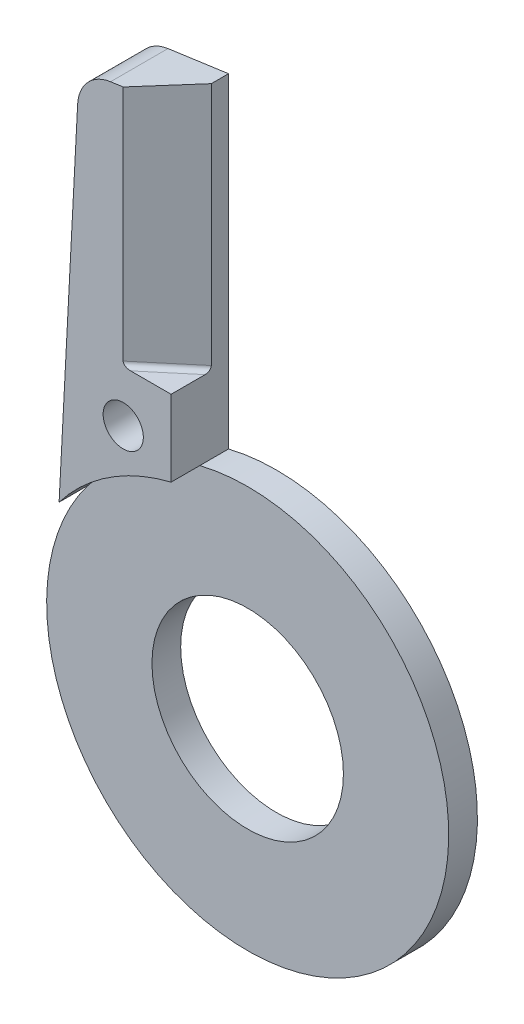
ISO-10303-21;
HEADER;
FILE_DESCRIPTION(('STEP AP214'),'2;1');
FILE_NAME('part.step','',(''),(''),'','','');
FILE_SCHEMA(('AUTOMOTIVE_DESIGN { 1 0 10303 214 1 1 1 1 }'));
ENDSEC;
DATA;
#1=APPLICATION_CONTEXT('core data for automotive mechanical design processes');
#2=APPLICATION_PROTOCOL_DEFINITION('international standard','automotive_design',2000,#1);
#3=PRODUCT_CONTEXT('',#1,'mechanical');
#4=PRODUCT('Part','Part','',(#3));
#5=PRODUCT_RELATED_PRODUCT_CATEGORY('part','',(#4));
#6=PRODUCT_DEFINITION_FORMATION('','',#4);
#7=PRODUCT_DEFINITION_CONTEXT('part definition',#1,'design');
#8=PRODUCT_DEFINITION('design','',#6,#7);
#9=PRODUCT_DEFINITION_SHAPE('','',#8);
#10=(LENGTH_UNIT() NAMED_UNIT(*) SI_UNIT(.MILLI.,.METRE.));
#11=(NAMED_UNIT(*) PLANE_ANGLE_UNIT() SI_UNIT($,.RADIAN.));
#12=(NAMED_UNIT(*) SI_UNIT($,.STERADIAN.) SOLID_ANGLE_UNIT());
#13=UNCERTAINTY_MEASURE_WITH_UNIT(LENGTH_MEASURE(1.E-05),#10,'distance_accuracy_value','');
#14=(GEOMETRIC_REPRESENTATION_CONTEXT(3) GLOBAL_UNCERTAINTY_ASSIGNED_CONTEXT((#13)) GLOBAL_UNIT_ASSIGNED_CONTEXT((#10,
#11,#12)) REPRESENTATION_CONTEXT('',''));
#15=CARTESIAN_POINT('',(0.,0.,0.));
#16=DIRECTION('',(0.,0.,1.));
#17=DIRECTION('',(1.,0.,0.));
#18=AXIS2_PLACEMENT_3D('',#15,#16,#17);
#19=CARTESIAN_POINT('',(0.,0.,6.));
#20=DIRECTION('',(0.,0.,-1.));
#21=DIRECTION('',(-1.,0.,0.));
#22=AXIS2_PLACEMENT_3D('',#19,#20,#21);
#23=CYLINDRICAL_SURFACE('',#22,21.);
#24=CARTESIAN_POINT('',(0.,0.,3.));
#25=DIRECTION('',(0.,0.,1.));
#26=DIRECTION('',(1.,0.,0.));
#27=AXIS2_PLACEMENT_3D('',#24,#25,#26);
#28=CIRCLE('',#27,21.);
#29=CARTESIAN_POINT('',(-16.7,12.7322425361756,3.));
#30=VERTEX_POINT('',#29);
#31=CARTESIAN_POINT('',(-4.99999999999998,20.3960780543711,3.));
#32=VERTEX_POINT('',#31);
#33=EDGE_CURVE('E190',#30,#32,#28,.T.);
#34=ORIENTED_EDGE('',*,*,#33,.F.);
#35=DIRECTION('',(0.,0.,-1.));
#36=VECTOR('',#35,1.);
#37=CARTESIAN_POINT('',(-16.7,12.7322425361756,6.));
#38=LINE('',#37,#36);
#39=CARTESIAN_POINT('',(-16.7,12.7322425361756,0.));
#40=VERTEX_POINT('',#39);
#41=EDGE_CURVE('E156',#30,#40,#38,.T.);
#42=ORIENTED_EDGE('',*,*,#41,.T.);
#43=CARTESIAN_POINT('',(0.,0.,0.));
#44=DIRECTION('',(0.,0.,1.));
#45=DIRECTION('',(1.,0.,0.));
#46=AXIS2_PLACEMENT_3D('',#43,#44,#45);
#47=CIRCLE('',#46,21.);
#48=CARTESIAN_POINT('',(-4.99999999999998,20.3960780543711,0.));
#49=VERTEX_POINT('',#48);
#50=EDGE_CURVE('E141',#40,#49,#47,.T.);
#51=ORIENTED_EDGE('',*,*,#50,.T.);
#52=DIRECTION('',(0.,0.,-1.));
#53=VECTOR('',#52,1.);
#54=CARTESIAN_POINT('',(-4.99999999999998,20.3960780543711,6.));
#55=LINE('',#54,#53);
#56=EDGE_CURVE('E153',#32,#49,#55,.T.);
#57=ORIENTED_EDGE('',*,*,#56,.F.);
#58=EDGE_LOOP('',(#34,#42,#51,#57));
#59=FACE_BOUND('',#58,.T.);
#60=ADVANCED_FACE('F34',(#59),#23,.T.);
#61=CARTESIAN_POINT('',(0.,0.,6.));
#62=DIRECTION('',(0.,0.,-1.));
#63=DIRECTION('',(-1.,0.,0.));
#64=AXIS2_PLACEMENT_3D('',#61,#62,#63);
#65=CYLINDRICAL_SURFACE('',#64,10.);
#66=CARTESIAN_POINT('',(0.,0.,0.));
#67=DIRECTION('',(0.,0.,1.));
#68=DIRECTION('',(1.,0.,0.));
#69=AXIS2_PLACEMENT_3D('',#66,#67,#68);
#70=CIRCLE('',#69,10.);
#71=CARTESIAN_POINT('',(10.,0.,0.));
#72=VERTEX_POINT('',#71);
#73=EDGE_CURVE('E138',#72,#72,#70,.T.);
#74=ORIENTED_EDGE('',*,*,#73,.F.);
#75=EDGE_LOOP('',(#74));
#76=FACE_BOUND('',#75,.T.);
#77=CARTESIAN_POINT('',(0.,0.,3.));
#78=DIRECTION('',(0.,0.,1.));
#79=DIRECTION('',(1.,0.,0.));
#80=AXIS2_PLACEMENT_3D('',#77,#78,#79);
#81=CIRCLE('',#80,10.);
#82=CARTESIAN_POINT('',(10.,0.,3.));
#83=VERTEX_POINT('',#82);
#84=EDGE_CURVE('E191',#83,#83,#81,.T.);
#85=ORIENTED_EDGE('',*,*,#84,.T.);
#86=EDGE_LOOP('',(#85));
#87=FACE_BOUND('',#86,.T.);
#88=ADVANCED_FACE('F215',(#76,#87),#65,.F.);
#89=CARTESIAN_POINT('',(-10.7677078476653,49.4978295292275,6.));
#90=DIRECTION('',(0.,0.,-1.));
#91=DIRECTION('',(-1.,0.,0.));
#92=AXIS2_PLACEMENT_3D('',#89,#90,#91);
#93=PLANE('',#92);
#94=CARTESIAN_POINT('',(-10.,23.,6.));
#95=DIRECTION('',(0.,0.,1.));
#96=DIRECTION('',(1.,0.,0.));
#97=AXIS2_PLACEMENT_3D('',#94,#95,#96);
#98=CIRCLE('',#97,2.1);
#99=CARTESIAN_POINT('',(-7.9,23.,6.));
#100=VERTEX_POINT('',#99);
#101=EDGE_CURVE('E199',#100,#100,#98,.T.);
#102=ORIENTED_EDGE('',*,*,#101,.F.);
#103=EDGE_LOOP('',(#102));
#104=FACE_BOUND('',#103,.T.);
#105=DIRECTION('',(1.,0.,0.));
#106=VECTOR('',#105,1.);
#107=CARTESIAN_POINT('',(-5.,28.3477382945324,6.));
#108=LINE('',#107,#106);
#109=CARTESIAN_POINT('',(-9.22750317546553,28.3477382945324,6.));
#110=VERTEX_POINT('',#109);
#111=CARTESIAN_POINT('',(-5.,28.3477382945324,6.));
#112=VERTEX_POINT('',#111);
#113=EDGE_CURVE('E104',#110,#112,#108,.T.);
#114=ORIENTED_EDGE('',*,*,#113,.F.);
#115=CARTESIAN_POINT('',(-9.22750317546553,28.8477382945324,6.));
#116=DIRECTION('',(0.,0.,-1.));
#117=DIRECTION('',(-1.,0.,0.));
#118=AXIS2_PLACEMENT_3D('',#115,#116,#117);
#119=ELLIPSE('',#118,0.777861913430211,0.5);
#120=CARTESIAN_POINT('',(-10.0053650888957,28.8477382945324,6.));
#121=VERTEX_POINT('',#120);
#122=EDGE_CURVE('E43',#110,#121,#119,.T.);
#123=ORIENTED_EDGE('',*,*,#122,.T.);
#124=DIRECTION('',(0.,1.,0.));
#125=VECTOR('',#124,1.);
#126=CARTESIAN_POINT('',(-10.0053650888957,28.3477382945324,6.));
#127=LINE('',#126,#125);
#128=CARTESIAN_POINT('',(-10.0053650888957,53.6442801069487,6.));
#129=VERTEX_POINT('',#128);
#130=EDGE_CURVE('E196',#121,#129,#127,.T.);
#131=ORIENTED_EDGE('',*,*,#130,.T.);
#132=DIRECTION('',(-0.99026806874157,-0.13917310096007,0.));
#133=VECTOR('',#132,1.);
#134=CARTESIAN_POINT('',(-11.3244002515055,53.4589018041937,6.));
#135=LINE('',#134,#133);
#136=CARTESIAN_POINT('',(-11.3244002515055,53.4589018041937,6.));
#137=VERTEX_POINT('',#136);
#138=EDGE_CURVE('E125',#129,#137,#135,.T.);
#139=ORIENTED_EDGE('',*,*,#138,.T.);
#140=CARTESIAN_POINT('',(-10.7677078476653,49.4978295292275,6.));
#141=DIRECTION('',(0.,0.,1.));
#142=DIRECTION('',(-1.,0.,0.));
#143=AXIS2_PLACEMENT_3D('',#140,#141,#142);
#144=CIRCLE('',#143,4.);
#145=CARTESIAN_POINT('',(-14.7622259866836,49.7071733541992,6.));
#146=VERTEX_POINT('',#145);
#147=EDGE_CURVE('E130',#137,#146,#144,.T.);
#148=ORIENTED_EDGE('',*,*,#147,.T.);
#149=DIRECTION('',(-0.0523359562429367,-0.998629534754574,0.));
#150=VECTOR('',#149,1.);
#151=CARTESIAN_POINT('',(-16.7,12.7322425361756,6.));
#152=LINE('',#151,#150);
#153=CARTESIAN_POINT('',(-16.7,12.7322425361756,6.));
#154=VERTEX_POINT('',#153);
#155=EDGE_CURVE('E126',#146,#154,#152,.T.);
#156=ORIENTED_EDGE('',*,*,#155,.T.);
#157=CARTESIAN_POINT('',(0.,0.,6.));
#158=DIRECTION('',(0.,0.,1.));
#159=DIRECTION('',(1.,0.,0.));
#160=AXIS2_PLACEMENT_3D('',#157,#158,#159);
#161=CIRCLE('',#160,21.);
#162=CARTESIAN_POINT('',(-4.99999999999999,20.3960780543711,6.));
#163=VERTEX_POINT('',#162);
#164=EDGE_CURVE('E124',#163,#154,#161,.T.);
#165=ORIENTED_EDGE('',*,*,#164,.F.);
#166=DIRECTION('',(0.,1.,0.));
#167=VECTOR('',#166,1.);
#168=CARTESIAN_POINT('',(-5.,54.3477382945324,6.));
#169=LINE('',#168,#167);
#170=EDGE_CURVE('E117',#163,#112,#169,.T.);
#171=ORIENTED_EDGE('',*,*,#170,.T.);
#172=EDGE_LOOP('',(#114,#123,#131,#139,#148,#156,#165,#171));
#173=FACE_BOUND('',#172,.T.);
#174=ADVANCED_FACE('F122',(#104,#173),#93,.F.);
#175=CARTESIAN_POINT('',(-10.7677078476653,49.4978295292275,0.));
#176=DIRECTION('',(0.,0.,-1.));
#177=DIRECTION('',(-1.,0.,0.));
#178=AXIS2_PLACEMENT_3D('',#175,#176,#177);
#179=PLANE('',#178);
#180=CARTESIAN_POINT('',(-10.,23.,0.));
#181=DIRECTION('',(0.,0.,-1.));
#182=DIRECTION('',(-1.,0.,0.));
#183=AXIS2_PLACEMENT_3D('',#180,#181,#182);
#184=CIRCLE('',#183,2.1);
#185=CARTESIAN_POINT('',(-12.1,23.,0.));
#186=VERTEX_POINT('',#185);
#187=EDGE_CURVE('E38',#186,#186,#184,.T.);
#188=ORIENTED_EDGE('',*,*,#187,.F.);
#189=EDGE_LOOP('',(#188));
#190=FACE_BOUND('',#189,.T.);
#191=CARTESIAN_POINT('',(-10.7677078476653,49.4978295292275,0.));
#192=DIRECTION('',(0.,0.,1.));
#193=DIRECTION('',(-1.,0.,0.));
#194=AXIS2_PLACEMENT_3D('',#191,#192,#193);
#195=CIRCLE('',#194,4.);
#196=CARTESIAN_POINT('',(-11.3244002515055,53.4589018041937,0.));
#197=VERTEX_POINT('',#196);
#198=CARTESIAN_POINT('',(-14.7622259866836,49.7071733541992,0.));
#199=VERTEX_POINT('',#198);
#200=EDGE_CURVE('E134',#197,#199,#195,.T.);
#201=ORIENTED_EDGE('',*,*,#200,.F.);
#202=DIRECTION('',(-0.99026806874157,-0.13917310096007,0.));
#203=VECTOR('',#202,1.);
#204=CARTESIAN_POINT('',(-11.3244002515055,53.4589018041937,0.));
#205=LINE('',#204,#203);
#206=CARTESIAN_POINT('',(-5.,54.3477382945324,0.));
#207=VERTEX_POINT('',#206);
#208=EDGE_CURVE('E147',#207,#197,#205,.T.);
#209=ORIENTED_EDGE('',*,*,#208,.F.);
#210=DIRECTION('',(0.,1.,0.));
#211=VECTOR('',#210,1.);
#212=CARTESIAN_POINT('',(-5.,54.3477382945324,0.));
#213=LINE('',#212,#211);
#214=EDGE_CURVE('E144',#49,#207,#213,.T.);
#215=ORIENTED_EDGE('',*,*,#214,.F.);
#216=ORIENTED_EDGE('',*,*,#50,.F.);
#217=DIRECTION('',(-0.0523359562429367,-0.998629534754574,0.));
#218=VECTOR('',#217,1.);
#219=CARTESIAN_POINT('',(-16.7,12.7322425361756,0.));
#220=LINE('',#219,#218);
#221=EDGE_CURVE('E137',#199,#40,#220,.T.);
#222=ORIENTED_EDGE('',*,*,#221,.F.);
#223=EDGE_LOOP('',(#201,#209,#215,#216,#222));
#224=FACE_BOUND('',#223,.T.);
#225=ORIENTED_EDGE('',*,*,#73,.T.);
#226=EDGE_LOOP('',(#225));
#227=FACE_BOUND('',#226,.T.);
#228=ADVANCED_FACE('F178',(#190,#224,#227),#179,.T.);
#229=CARTESIAN_POINT('',(-10.7677078476653,49.4978295292275,6.));
#230=DIRECTION('',(0.,0.,-1.));
#231=DIRECTION('',(-1.,0.,0.));
#232=AXIS2_PLACEMENT_3D('',#229,#230,#231);
#233=CYLINDRICAL_SURFACE('',#232,4.);
#234=ORIENTED_EDGE('',*,*,#200,.T.);
#235=DIRECTION('',(0.,0.,-1.));
#236=VECTOR('',#235,1.);
#237=CARTESIAN_POINT('',(-14.7622259866836,49.7071733541992,6.));
#238=LINE('',#237,#236);
#239=EDGE_CURVE('E159',#146,#199,#238,.T.);
#240=ORIENTED_EDGE('',*,*,#239,.F.);
#241=ORIENTED_EDGE('',*,*,#147,.F.);
#242=DIRECTION('',(0.,0.,-1.));
#243=VECTOR('',#242,1.);
#244=CARTESIAN_POINT('',(-11.3244002515055,53.4589018041937,6.));
#245=LINE('',#244,#243);
#246=EDGE_CURVE('E128',#137,#197,#245,.T.);
#247=ORIENTED_EDGE('',*,*,#246,.T.);
#248=EDGE_LOOP('',(#234,#240,#241,#247));
#249=FACE_BOUND('',#248,.T.);
#250=ADVANCED_FACE('F182',(#249),#233,.T.);
#251=CARTESIAN_POINT('',(-16.7,12.7322425361756,6.));
#252=DIRECTION('',(0.998629534754574,-0.0523359562429367,0.));
#253=DIRECTION('',(0.0523359562429367,0.998629534754574,0.));
#254=AXIS2_PLACEMENT_3D('',#251,#252,#253);
#255=PLANE('',#254);
#256=ORIENTED_EDGE('',*,*,#221,.T.);
#257=ORIENTED_EDGE('',*,*,#41,.F.);
#258=EDGE_CURVE('E157',#154,#30,#38,.T.);
#259=ORIENTED_EDGE('',*,*,#258,.F.);
#260=ORIENTED_EDGE('',*,*,#155,.F.);
#261=ORIENTED_EDGE('',*,*,#239,.T.);
#262=EDGE_LOOP('',(#256,#257,#259,#260,#261));
#263=FACE_BOUND('',#262,.T.);
#264=ADVANCED_FACE('F214',(#263),#255,.F.);
#265=CARTESIAN_POINT('',(-5.,54.3477382945324,6.));
#266=DIRECTION('',(-1.,0.,0.));
#267=DIRECTION('',(0.,-1.,0.));
#268=AXIS2_PLACEMENT_3D('',#265,#266,#267);
#269=PLANE('',#268);
#270=DIRECTION('',(0.,0.,-1.));
#271=VECTOR('',#270,1.);
#272=CARTESIAN_POINT('',(-5.,54.3477382945324,6.));
#273=LINE('',#272,#271);
#274=CARTESIAN_POINT('',(-5.,54.3477382945324,1.8));
#275=VERTEX_POINT('',#274);
#276=EDGE_CURVE('E151',#275,#207,#273,.T.);
#277=ORIENTED_EDGE('',*,*,#276,.F.);
#278=DIRECTION('',(0.,1.,0.));
#279=VECTOR('',#278,1.);
#280=CARTESIAN_POINT('',(-5.,28.3477382945324,1.8));
#281=LINE('',#280,#279);
#282=CARTESIAN_POINT('',(-5.,28.8477382945324,1.8));
#283=VERTEX_POINT('',#282);
#284=EDGE_CURVE('E119',#283,#275,#281,.T.);
#285=ORIENTED_EDGE('',*,*,#284,.F.);
#286=CARTESIAN_POINT('',(-5.,28.8477382945324,2.45270364466613));
#287=DIRECTION('',(-1.,0.,0.));
#288=DIRECTION('',(0.,0.,1.));
#289=AXIS2_PLACEMENT_3D('',#286,#287,#288);
#290=ELLIPSE('',#289,0.652703644666136,0.5);
#291=CARTESIAN_POINT('',(-5.,28.3477382945324,2.45270364466614));
#292=VERTEX_POINT('',#291);
#293=EDGE_CURVE('E11',#283,#292,#290,.T.);
#294=ORIENTED_EDGE('',*,*,#293,.T.);
#295=DIRECTION('',(0.,0.,-1.));
#296=VECTOR('',#295,1.);
#297=CARTESIAN_POINT('',(-5.,28.3477382945324,1.8));
#298=LINE('',#297,#296);
#299=EDGE_CURVE('E107',#112,#292,#298,.T.);
#300=ORIENTED_EDGE('',*,*,#299,.F.);
#301=ORIENTED_EDGE('',*,*,#170,.F.);
#302=EDGE_CURVE('E154',#163,#32,#55,.T.);
#303=ORIENTED_EDGE('',*,*,#302,.T.);
#304=ORIENTED_EDGE('',*,*,#56,.T.);
#305=ORIENTED_EDGE('',*,*,#214,.T.);
#306=EDGE_LOOP('',(#277,#285,#294,#300,#301,#303,#304,#305));
#307=FACE_BOUND('',#306,.T.);
#308=ADVANCED_FACE('F115',(#307),#269,.F.);
#309=CARTESIAN_POINT('',(-11.3244002515055,53.4589018041937,6.));
#310=DIRECTION('',(0.13917310096007,-0.990268068741569,0.));
#311=DIRECTION('',(0.99026806874157,0.13917310096007,0.));
#312=AXIS2_PLACEMENT_3D('',#309,#310,#311);
#313=PLANE('',#312);
#314=ORIENTED_EDGE('',*,*,#138,.F.);
#315=DIRECTION('',(0.761643137673301,0.107041962313958,-0.639094475910366));
#316=VECTOR('',#315,1.);
#317=CARTESIAN_POINT('',(-10.7856512225132,53.5346180424234,6.65473780693111));
#318=LINE('',#317,#316);
#319=EDGE_CURVE('E162',#129,#275,#318,.T.);
#320=ORIENTED_EDGE('',*,*,#319,.T.);
#321=ORIENTED_EDGE('',*,*,#276,.T.);
#322=ORIENTED_EDGE('',*,*,#208,.T.);
#323=ORIENTED_EDGE('',*,*,#246,.F.);
#324=EDGE_LOOP('',(#314,#320,#321,#322,#323));
#325=FACE_BOUND('',#324,.T.);
#326=ADVANCED_FACE('F170',(#325),#313,.F.);
#327=CARTESIAN_POINT('',(0.,0.,3.));
#328=DIRECTION('',(0.,0.,1.));
#329=DIRECTION('',(1.,0.,0.));
#330=AXIS2_PLACEMENT_3D('',#327,#328,#329);
#331=CYLINDRICAL_SURFACE('',#330,21.);
#332=EDGE_CURVE('E188',#32,#30,#28,.T.);
#333=ORIENTED_EDGE('',*,*,#332,.F.);
#334=ORIENTED_EDGE('',*,*,#302,.F.);
#335=ORIENTED_EDGE('',*,*,#164,.T.);
#336=ORIENTED_EDGE('',*,*,#258,.T.);
#337=EDGE_LOOP('',(#333,#334,#335,#336));
#338=FACE_BOUND('',#337,.T.);
#339=ADVANCED_FACE('F241',(#338),#331,.F.);
#340=CARTESIAN_POINT('',(0.,0.,3.));
#341=DIRECTION('',(0.,0.,1.));
#342=DIRECTION('',(1.,0.,0.));
#343=AXIS2_PLACEMENT_3D('',#340,#341,#342);
#344=PLANE('',#343);
#345=ORIENTED_EDGE('',*,*,#84,.F.);
#346=EDGE_LOOP('',(#345));
#347=FACE_BOUND('',#346,.T.);
#348=ORIENTED_EDGE('',*,*,#332,.T.);
#349=ORIENTED_EDGE('',*,*,#33,.T.);
#350=EDGE_LOOP('',(#348,#349));
#351=FACE_BOUND('',#350,.T.);
#352=ADVANCED_FACE('F239',(#347,#351),#344,.T.);
#353=CARTESIAN_POINT('',(-10.0053650888957,28.3477382945324,6.));
#354=DIRECTION('',(-0.642787609686535,0.,-0.766044443118982));
#355=DIRECTION('',(-0.766044443118982,0.,0.642787609686535));
#356=AXIS2_PLACEMENT_3D('',#353,#354,#355);
#357=PLANE('',#356);
#358=ORIENTED_EDGE('',*,*,#130,.F.);
#359=DIRECTION('',(-0.766044443118982,0.,0.642787609686535));
#360=VECTOR('',#359,1.);
#361=CARTESIAN_POINT('',(-10.0053650888957,28.8477382945324,6.));
#362=LINE('',#361,#360);
#363=EDGE_CURVE('E50',#121,#283,#362,.F.);
#364=ORIENTED_EDGE('',*,*,#363,.T.);
#365=ORIENTED_EDGE('',*,*,#284,.T.);
#366=ORIENTED_EDGE('',*,*,#319,.F.);
#367=EDGE_LOOP('',(#358,#364,#365,#366));
#368=FACE_BOUND('',#367,.T.);
#369=ADVANCED_FACE('F248',(#368),#357,.F.);
#370=CARTESIAN_POINT('',(-5.,28.3477382945324,6.));
#371=DIRECTION('',(0.,1.,0.));
#372=DIRECTION('',(0.,0.,1.));
#373=AXIS2_PLACEMENT_3D('',#370,#371,#372);
#374=PLANE('',#373);
#375=ORIENTED_EDGE('',*,*,#299,.T.);
#376=DIRECTION('',(-0.766044443118982,0.,0.642787609686535));
#377=VECTOR('',#376,1.);
#378=CARTESIAN_POINT('',(-6.74670247648236,28.3477382945324,3.91836104845891));
#379=LINE('',#378,#377);
#380=EDGE_CURVE('E109',#292,#110,#379,.T.);
#381=ORIENTED_EDGE('',*,*,#380,.T.);
#382=ORIENTED_EDGE('',*,*,#113,.T.);
#383=EDGE_LOOP('',(#375,#381,#382));
#384=FACE_BOUND('',#383,.T.);
#385=ADVANCED_FACE('F106',(#384),#374,.T.);
#386=CARTESIAN_POINT('',(-6.74670247648236,28.8477382945324,3.91836104845891));
#387=DIRECTION('',(-0.766044443118982,0.,0.642787609686535));
#388=DIRECTION('',(0.642787609686535,0.,0.766044443118982));
#389=AXIS2_PLACEMENT_3D('',#386,#387,#388);
#390=CYLINDRICAL_SURFACE('',#389,0.5);
#391=ORIENTED_EDGE('',*,*,#293,.F.);
#392=ORIENTED_EDGE('',*,*,#363,.F.);
#393=ORIENTED_EDGE('',*,*,#122,.F.);
#394=ORIENTED_EDGE('',*,*,#380,.F.);
#395=EDGE_LOOP('',(#391,#392,#393,#394));
#396=FACE_BOUND('',#395,.T.);
#397=ADVANCED_FACE('F36',(#396),#390,.F.);
#398=CARTESIAN_POINT('',(-10.,23.,6.));
#399=DIRECTION('',(0.,0.,1.));
#400=DIRECTION('',(1.,0.,0.));
#401=AXIS2_PLACEMENT_3D('',#398,#399,#400);
#402=CYLINDRICAL_SURFACE('',#401,2.1);
#403=ORIENTED_EDGE('',*,*,#187,.T.);
#404=EDGE_LOOP('',(#403));
#405=FACE_BOUND('',#404,.T.);
#406=ORIENTED_EDGE('',*,*,#101,.T.);
#407=EDGE_LOOP('',(#406));
#408=FACE_BOUND('',#407,.T.);
#409=ADVANCED_FACE('F206',(#405,#408),#402,.F.);
#410=CLOSED_SHELL('',(#60,#88,#174,#228,#250,#264,#308,#326,#339,#352,#369,#385,#397,#409));
#411=MANIFOLD_SOLID_BREP('B2',#410);
#412=ADVANCED_BREP_SHAPE_REPRESENTATION('',(#18,#411),#14);
#413=SHAPE_DEFINITION_REPRESENTATION(#9,#412);
ENDSEC;
END-ISO-10303-21;
